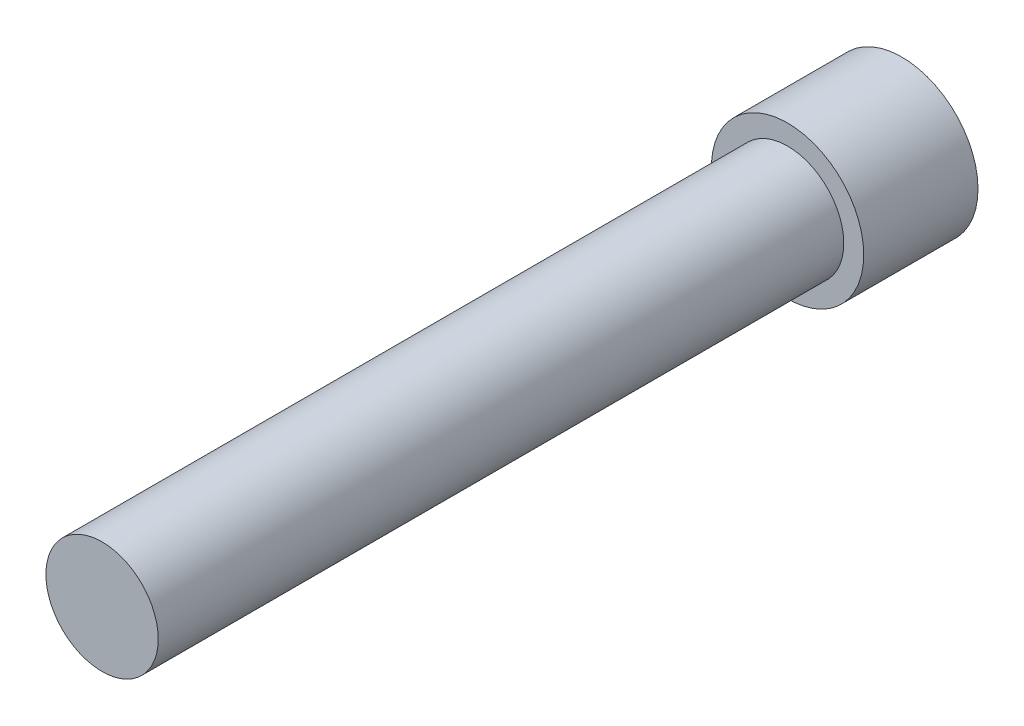
ISO-10303-21;
HEADER;
FILE_DESCRIPTION(('STEP AP214'),'2;1');
FILE_NAME('part.step','',(''),(''),'','','');
FILE_SCHEMA(('AUTOMOTIVE_DESIGN { 1 0 10303 214 1 1 1 1 }'));
ENDSEC;
DATA;
#1=APPLICATION_CONTEXT('core data for automotive mechanical design processes');
#2=APPLICATION_PROTOCOL_DEFINITION('international standard','automotive_design',2000,#1);
#3=PRODUCT_CONTEXT('',#1,'mechanical');
#4=PRODUCT('Part','Part','',(#3));
#5=PRODUCT_RELATED_PRODUCT_CATEGORY('part','',(#4));
#6=PRODUCT_DEFINITION_FORMATION('','',#4);
#7=PRODUCT_DEFINITION_CONTEXT('part definition',#1,'design');
#8=PRODUCT_DEFINITION('design','',#6,#7);
#9=PRODUCT_DEFINITION_SHAPE('','',#8);
#10=(LENGTH_UNIT() NAMED_UNIT(*) SI_UNIT(.MILLI.,.METRE.));
#11=(NAMED_UNIT(*) PLANE_ANGLE_UNIT() SI_UNIT($,.RADIAN.));
#12=(NAMED_UNIT(*) SI_UNIT($,.STERADIAN.) SOLID_ANGLE_UNIT());
#13=UNCERTAINTY_MEASURE_WITH_UNIT(LENGTH_MEASURE(1.E-05),#10,'distance_accuracy_value','');
#14=(GEOMETRIC_REPRESENTATION_CONTEXT(3) GLOBAL_UNCERTAINTY_ASSIGNED_CONTEXT((#13)) GLOBAL_UNIT_ASSIGNED_CONTEXT((#10,
#11,#12)) REPRESENTATION_CONTEXT('',''));
#15=CARTESIAN_POINT('',(0.,0.,0.));
#16=DIRECTION('',(0.,0.,1.));
#17=DIRECTION('',(1.,0.,0.));
#18=AXIS2_PLACEMENT_3D('',#15,#16,#17);
#19=CARTESIAN_POINT('',(0.,0.,3.));
#20=DIRECTION('',(0.,0.,1.));
#21=DIRECTION('',(1.,0.,0.));
#22=AXIS2_PLACEMENT_3D('',#19,#20,#21);
#23=PLANE('',#22);
#24=CARTESIAN_POINT('',(0.,0.,3.));
#25=DIRECTION('',(0.,0.,1.));
#26=DIRECTION('',(1.,0.,0.));
#27=AXIS2_PLACEMENT_3D('',#24,#25,#26);
#28=CIRCLE('',#27,2.);
#29=CARTESIAN_POINT('',(2.,0.,3.));
#30=VERTEX_POINT('',#29);
#31=EDGE_CURVE('E11',#30,#30,#28,.T.);
#32=ORIENTED_EDGE('',*,*,#31,.T.);
#33=EDGE_LOOP('',(#32));
#34=FACE_BOUND('',#33,.T.);
#35=CARTESIAN_POINT('',(0.,0.,3.));
#36=DIRECTION('',(0.,0.,1.));
#37=DIRECTION('',(1.,0.,0.));
#38=AXIS2_PLACEMENT_3D('',#35,#36,#37);
#39=CIRCLE('',#38,1.475);
#40=CARTESIAN_POINT('',(1.475,0.,3.));
#41=VERTEX_POINT('',#40);
#42=EDGE_CURVE('E150',#41,#41,#39,.T.);
#43=ORIENTED_EDGE('',*,*,#42,.F.);
#44=EDGE_LOOP('',(#43));
#45=FACE_BOUND('',#44,.T.);
#46=ADVANCED_FACE('F31',(#34,#45),#23,.T.);
#47=CARTESIAN_POINT('',(0.,0.,3.));
#48=DIRECTION('',(0.,0.,-1.));
#49=DIRECTION('',(-1.,0.,0.));
#50=AXIS2_PLACEMENT_3D('',#47,#48,#49);
#51=CYLINDRICAL_SURFACE('',#50,2.);
#52=ORIENTED_EDGE('',*,*,#31,.F.);
#53=EDGE_LOOP('',(#52));
#54=FACE_BOUND('',#53,.T.);
#55=CARTESIAN_POINT('',(0.,0.,0.));
#56=DIRECTION('',(0.,0.,1.));
#57=DIRECTION('',(1.,0.,0.));
#58=AXIS2_PLACEMENT_3D('',#55,#56,#57);
#59=CIRCLE('',#58,2.);
#60=CARTESIAN_POINT('',(2.,0.,0.));
#61=VERTEX_POINT('',#60);
#62=EDGE_CURVE('E35',#61,#61,#59,.T.);
#63=ORIENTED_EDGE('',*,*,#62,.T.);
#64=EDGE_LOOP('',(#63));
#65=FACE_BOUND('',#64,.T.);
#66=ADVANCED_FACE('F33',(#54,#65),#51,.T.);
#67=CARTESIAN_POINT('',(0.,0.,0.));
#68=DIRECTION('',(0.,0.,1.));
#69=DIRECTION('',(1.,0.,0.));
#70=AXIS2_PLACEMENT_3D('',#67,#68,#69);
#71=PLANE('',#70);
#72=DIRECTION('',(-0.5,-0.866025403784439,0.));
#73=VECTOR('',#72,1.);
#74=CARTESIAN_POINT('',(1.44337567297407,0.,0.));
#75=LINE('',#74,#73);
#76=CARTESIAN_POINT('',(1.44337567297407,0.,0.));
#77=VERTEX_POINT('',#76);
#78=CARTESIAN_POINT('',(0.721687836487033,-1.25,0.));
#79=VERTEX_POINT('',#78);
#80=EDGE_CURVE('E120',#77,#79,#75,.T.);
#81=ORIENTED_EDGE('',*,*,#80,.F.);
#82=DIRECTION('',(0.5,-0.866025403784439,0.));
#83=VECTOR('',#82,1.);
#84=CARTESIAN_POINT('',(0.721687836487033,1.25,0.));
#85=LINE('',#84,#83);
#86=CARTESIAN_POINT('',(0.721687836487033,1.25,0.));
#87=VERTEX_POINT('',#86);
#88=EDGE_CURVE('E46',#87,#77,#85,.T.);
#89=ORIENTED_EDGE('',*,*,#88,.F.);
#90=DIRECTION('',(1.,0.,0.));
#91=VECTOR('',#90,1.);
#92=CARTESIAN_POINT('',(-0.721687836487032,1.25,0.));
#93=LINE('',#92,#91);
#94=CARTESIAN_POINT('',(-0.721687836487032,1.25,0.));
#95=VERTEX_POINT('',#94);
#96=EDGE_CURVE('E130',#95,#87,#93,.T.);
#97=ORIENTED_EDGE('',*,*,#96,.F.);
#98=DIRECTION('',(0.5,0.866025403784438,0.));
#99=VECTOR('',#98,1.);
#100=CARTESIAN_POINT('',(-1.44337567297407,0.,0.));
#101=LINE('',#100,#99);
#102=CARTESIAN_POINT('',(-1.44337567297407,0.,0.));
#103=VERTEX_POINT('',#102);
#104=EDGE_CURVE('E128',#103,#95,#101,.T.);
#105=ORIENTED_EDGE('',*,*,#104,.F.);
#106=DIRECTION('',(-0.5,0.866025403784439,0.));
#107=VECTOR('',#106,1.);
#108=CARTESIAN_POINT('',(-0.721687836487033,-1.25,0.));
#109=LINE('',#108,#107);
#110=CARTESIAN_POINT('',(-0.721687836487033,-1.25,0.));
#111=VERTEX_POINT('',#110);
#112=EDGE_CURVE('E94',#111,#103,#109,.T.);
#113=ORIENTED_EDGE('',*,*,#112,.F.);
#114=DIRECTION('',(-1.,0.,0.));
#115=VECTOR('',#114,1.);
#116=CARTESIAN_POINT('',(0.721687836487033,-1.25,0.));
#117=LINE('',#116,#115);
#118=EDGE_CURVE('E124',#79,#111,#117,.T.);
#119=ORIENTED_EDGE('',*,*,#118,.F.);
#120=EDGE_LOOP('',(#81,#89,#97,#105,#113,#119));
#121=FACE_BOUND('',#120,.T.);
#122=ORIENTED_EDGE('',*,*,#62,.F.);
#123=EDGE_LOOP('',(#122));
#124=FACE_BOUND('',#123,.T.);
#125=ADVANCED_FACE('F143',(#121,#124),#71,.F.);
#126=CARTESIAN_POINT('',(0.721687836487033,1.25,1.82));
#127=DIRECTION('',(0.866025403784439,0.5,0.));
#128=DIRECTION('',(-0.5,0.866025403784439,0.));
#129=AXIS2_PLACEMENT_3D('',#126,#127,#128);
#130=PLANE('',#129);
#131=ORIENTED_EDGE('',*,*,#88,.T.);
#132=DIRECTION('',(0.,0.,-1.));
#133=VECTOR('',#132,1.);
#134=CARTESIAN_POINT('',(1.44337567297407,0.,1.82));
#135=LINE('',#134,#133);
#136=CARTESIAN_POINT('',(1.44337567297407,0.,1.82));
#137=VERTEX_POINT('',#136);
#138=EDGE_CURVE('E76',#137,#77,#135,.T.);
#139=ORIENTED_EDGE('',*,*,#138,.F.);
#140=DIRECTION('',(0.5,-0.866025403784439,0.));
#141=VECTOR('',#140,1.);
#142=CARTESIAN_POINT('',(0.721687836487033,1.25,1.82));
#143=LINE('',#142,#141);
#144=CARTESIAN_POINT('',(0.721687836487033,1.25,1.82));
#145=VERTEX_POINT('',#144);
#146=EDGE_CURVE('E132',#145,#137,#143,.T.);
#147=ORIENTED_EDGE('',*,*,#146,.F.);
#148=DIRECTION('',(0.,0.,-1.));
#149=VECTOR('',#148,1.);
#150=CARTESIAN_POINT('',(0.721687836487033,1.25,1.82));
#151=LINE('',#150,#149);
#152=EDGE_CURVE('E54',#145,#87,#151,.T.);
#153=ORIENTED_EDGE('',*,*,#152,.T.);
#154=EDGE_LOOP('',(#131,#139,#147,#153));
#155=FACE_BOUND('',#154,.T.);
#156=ADVANCED_FACE('F172',(#155),#130,.F.);
#157=CARTESIAN_POINT('',(-0.721687836487032,1.25,1.82));
#158=DIRECTION('',(0.,1.,0.));
#159=DIRECTION('',(0.,0.,1.));
#160=AXIS2_PLACEMENT_3D('',#157,#158,#159);
#161=PLANE('',#160);
#162=ORIENTED_EDGE('',*,*,#96,.T.);
#163=ORIENTED_EDGE('',*,*,#152,.F.);
#164=DIRECTION('',(1.,0.,0.));
#165=VECTOR('',#164,1.);
#166=CARTESIAN_POINT('',(-0.721687836487032,1.25,1.82));
#167=LINE('',#166,#165);
#168=CARTESIAN_POINT('',(-0.721687836487032,1.25,1.82));
#169=VERTEX_POINT('',#168);
#170=EDGE_CURVE('E106',#169,#145,#167,.T.);
#171=ORIENTED_EDGE('',*,*,#170,.F.);
#172=DIRECTION('',(0.,0.,-1.));
#173=VECTOR('',#172,1.);
#174=CARTESIAN_POINT('',(-0.721687836487032,1.25,1.82));
#175=LINE('',#174,#173);
#176=EDGE_CURVE('E98',#169,#95,#175,.T.);
#177=ORIENTED_EDGE('',*,*,#176,.T.);
#178=EDGE_LOOP('',(#162,#163,#171,#177));
#179=FACE_BOUND('',#178,.T.);
#180=ADVANCED_FACE('F178',(#179),#161,.F.);
#181=CARTESIAN_POINT('',(-1.44337567297407,0.,1.82));
#182=DIRECTION('',(-0.866025403784438,0.5,0.));
#183=DIRECTION('',(-0.5,-0.866025403784438,0.));
#184=AXIS2_PLACEMENT_3D('',#181,#182,#183);
#185=PLANE('',#184);
#186=ORIENTED_EDGE('',*,*,#104,.T.);
#187=ORIENTED_EDGE('',*,*,#176,.F.);
#188=DIRECTION('',(0.5,0.866025403784438,0.));
#189=VECTOR('',#188,1.);
#190=CARTESIAN_POINT('',(-1.44337567297407,0.,1.82));
#191=LINE('',#190,#189);
#192=CARTESIAN_POINT('',(-1.44337567297407,0.,1.82));
#193=VERTEX_POINT('',#192);
#194=EDGE_CURVE('E102',#193,#169,#191,.T.);
#195=ORIENTED_EDGE('',*,*,#194,.F.);
#196=DIRECTION('',(0.,0.,-1.));
#197=VECTOR('',#196,1.);
#198=CARTESIAN_POINT('',(-1.44337567297407,0.,1.82));
#199=LINE('',#198,#197);
#200=EDGE_CURVE('E87',#193,#103,#199,.T.);
#201=ORIENTED_EDGE('',*,*,#200,.T.);
#202=EDGE_LOOP('',(#186,#187,#195,#201));
#203=FACE_BOUND('',#202,.T.);
#204=ADVANCED_FACE('F103',(#203),#185,.F.);
#205=CARTESIAN_POINT('',(-0.721687836487033,-1.25,1.82));
#206=DIRECTION('',(-0.866025403784439,-0.5,0.));
#207=DIRECTION('',(0.5,-0.866025403784439,0.));
#208=AXIS2_PLACEMENT_3D('',#205,#206,#207);
#209=PLANE('',#208);
#210=ORIENTED_EDGE('',*,*,#112,.T.);
#211=ORIENTED_EDGE('',*,*,#200,.F.);
#212=DIRECTION('',(-0.5,0.866025403784439,0.));
#213=VECTOR('',#212,1.);
#214=CARTESIAN_POINT('',(-0.721687836487033,-1.25,1.82));
#215=LINE('',#214,#213);
#216=CARTESIAN_POINT('',(-0.721687836487033,-1.25,1.82));
#217=VERTEX_POINT('',#216);
#218=EDGE_CURVE('E91',#217,#193,#215,.T.);
#219=ORIENTED_EDGE('',*,*,#218,.F.);
#220=DIRECTION('',(0.,0.,-1.));
#221=VECTOR('',#220,1.);
#222=CARTESIAN_POINT('',(-0.721687836487033,-1.25,1.82));
#223=LINE('',#222,#221);
#224=EDGE_CURVE('E99',#217,#111,#223,.T.);
#225=ORIENTED_EDGE('',*,*,#224,.T.);
#226=EDGE_LOOP('',(#210,#211,#219,#225));
#227=FACE_BOUND('',#226,.T.);
#228=ADVANCED_FACE('F89',(#227),#209,.F.);
#229=CARTESIAN_POINT('',(0.721687836487033,-1.25,1.82));
#230=DIRECTION('',(0.,-1.,0.));
#231=DIRECTION('',(0.,0.,-1.));
#232=AXIS2_PLACEMENT_3D('',#229,#230,#231);
#233=PLANE('',#232);
#234=ORIENTED_EDGE('',*,*,#118,.T.);
#235=ORIENTED_EDGE('',*,*,#224,.F.);
#236=DIRECTION('',(-1.,0.,0.));
#237=VECTOR('',#236,1.);
#238=CARTESIAN_POINT('',(0.721687836487033,-1.25,1.82));
#239=LINE('',#238,#237);
#240=CARTESIAN_POINT('',(0.721687836487033,-1.25,1.82));
#241=VERTEX_POINT('',#240);
#242=EDGE_CURVE('E112',#241,#217,#239,.T.);
#243=ORIENTED_EDGE('',*,*,#242,.F.);
#244=DIRECTION('',(0.,0.,-1.));
#245=VECTOR('',#244,1.);
#246=CARTESIAN_POINT('',(0.721687836487033,-1.25,1.82));
#247=LINE('',#246,#245);
#248=EDGE_CURVE('E136',#241,#79,#247,.T.);
#249=ORIENTED_EDGE('',*,*,#248,.T.);
#250=EDGE_LOOP('',(#234,#235,#243,#249));
#251=FACE_BOUND('',#250,.T.);
#252=ADVANCED_FACE('F147',(#251),#233,.F.);
#253=CARTESIAN_POINT('',(1.44337567297407,0.,1.82));
#254=DIRECTION('',(0.866025403784439,-0.5,0.));
#255=DIRECTION('',(0.5,0.866025403784439,0.));
#256=AXIS2_PLACEMENT_3D('',#253,#254,#255);
#257=PLANE('',#256);
#258=ORIENTED_EDGE('',*,*,#80,.T.);
#259=ORIENTED_EDGE('',*,*,#248,.F.);
#260=DIRECTION('',(-0.5,-0.866025403784439,0.));
#261=VECTOR('',#260,1.);
#262=CARTESIAN_POINT('',(1.44337567297407,0.,1.82));
#263=LINE('',#262,#261);
#264=EDGE_CURVE('E114',#137,#241,#263,.T.);
#265=ORIENTED_EDGE('',*,*,#264,.F.);
#266=ORIENTED_EDGE('',*,*,#138,.T.);
#267=EDGE_LOOP('',(#258,#259,#265,#266));
#268=FACE_BOUND('',#267,.T.);
#269=ADVANCED_FACE('F140',(#268),#257,.F.);
#270=CARTESIAN_POINT('',(1.44337567297407,0.,1.82));
#271=DIRECTION('',(0.,0.,-1.));
#272=DIRECTION('',(-1.,0.,0.));
#273=AXIS2_PLACEMENT_3D('',#270,#271,#272);
#274=PLANE('',#273);
#275=ORIENTED_EDGE('',*,*,#146,.T.);
#276=ORIENTED_EDGE('',*,*,#264,.T.);
#277=ORIENTED_EDGE('',*,*,#242,.T.);
#278=ORIENTED_EDGE('',*,*,#218,.T.);
#279=ORIENTED_EDGE('',*,*,#194,.T.);
#280=ORIENTED_EDGE('',*,*,#170,.T.);
#281=EDGE_LOOP('',(#275,#276,#277,#278,#279,#280));
#282=FACE_BOUND('',#281,.T.);
#283=ADVANCED_FACE('F109',(#282),#274,.T.);
#284=CARTESIAN_POINT('',(0.,0.,21.));
#285=DIRECTION('',(0.,0.,-1.));
#286=DIRECTION('',(-1.,0.,0.));
#287=AXIS2_PLACEMENT_3D('',#284,#285,#286);
#288=CYLINDRICAL_SURFACE('',#287,1.475);
#289=CARTESIAN_POINT('',(0.,0.,21.));
#290=DIRECTION('',(0.,0.,1.));
#291=DIRECTION('',(1.,0.,0.));
#292=AXIS2_PLACEMENT_3D('',#289,#290,#291);
#293=CIRCLE('',#292,1.475);
#294=CARTESIAN_POINT('',(1.475,0.,21.));
#295=VERTEX_POINT('',#294);
#296=EDGE_CURVE('E121',#295,#295,#293,.T.);
#297=ORIENTED_EDGE('',*,*,#296,.F.);
#298=EDGE_LOOP('',(#297));
#299=FACE_BOUND('',#298,.T.);
#300=ORIENTED_EDGE('',*,*,#42,.T.);
#301=EDGE_LOOP('',(#300));
#302=FACE_BOUND('',#301,.T.);
#303=ADVANCED_FACE('F158',(#299,#302),#288,.T.);
#304=CARTESIAN_POINT('',(0.,0.,21.));
#305=DIRECTION('',(0.,0.,1.));
#306=DIRECTION('',(1.,0.,0.));
#307=AXIS2_PLACEMENT_3D('',#304,#305,#306);
#308=PLANE('',#307);
#309=ORIENTED_EDGE('',*,*,#296,.T.);
#310=EDGE_LOOP('',(#309));
#311=FACE_BOUND('',#310,.T.);
#312=ADVANCED_FACE('F156',(#311),#308,.T.);
#313=CLOSED_SHELL('',(#46,#66,#125,#156,#180,#204,#228,#252,#269,#283,#303,#312));
#314=MANIFOLD_SOLID_BREP('B2',#313);
#315=ADVANCED_BREP_SHAPE_REPRESENTATION('',(#18,#314),#14);
#316=SHAPE_DEFINITION_REPRESENTATION(#9,#315);
ENDSEC;
END-ISO-10303-21;
